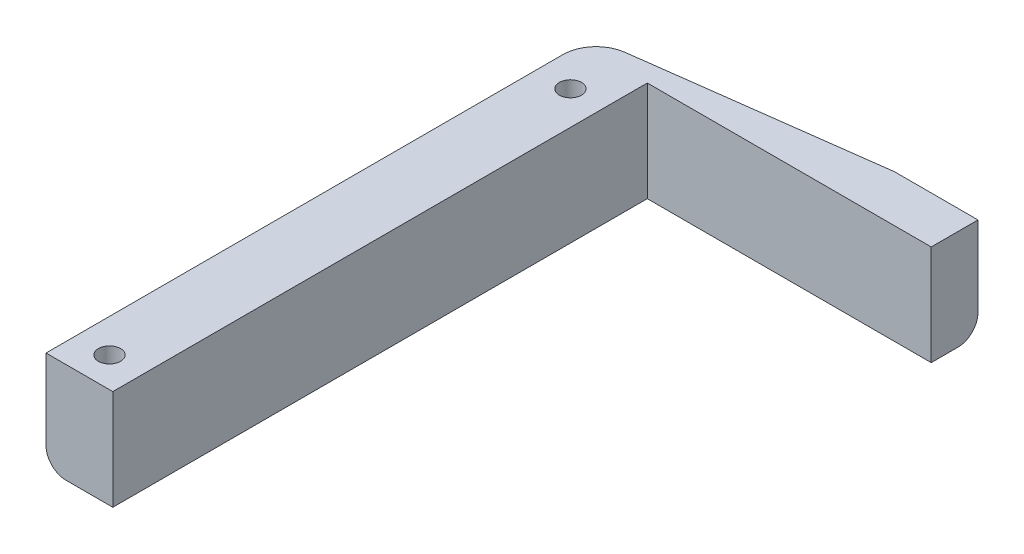
ISO-10303-21;
HEADER;
FILE_DESCRIPTION(('STEP AP214'),'2;1');
FILE_NAME('part.step','',(''),(''),'','','');
FILE_SCHEMA(('AUTOMOTIVE_DESIGN { 1 0 10303 214 1 1 1 1 }'));
ENDSEC;
DATA;
#1=APPLICATION_CONTEXT('core data for automotive mechanical design processes');
#2=APPLICATION_PROTOCOL_DEFINITION('international standard','automotive_design',2000,#1);
#3=PRODUCT_CONTEXT('',#1,'mechanical');
#4=PRODUCT('Part','Part','',(#3));
#5=PRODUCT_RELATED_PRODUCT_CATEGORY('part','',(#4));
#6=PRODUCT_DEFINITION_FORMATION('','',#4);
#7=PRODUCT_DEFINITION_CONTEXT('part definition',#1,'design');
#8=PRODUCT_DEFINITION('design','',#6,#7);
#9=PRODUCT_DEFINITION_SHAPE('','',#8);
#10=(LENGTH_UNIT() NAMED_UNIT(*) SI_UNIT(.MILLI.,.METRE.));
#11=(NAMED_UNIT(*) PLANE_ANGLE_UNIT() SI_UNIT($,.RADIAN.));
#12=(NAMED_UNIT(*) SI_UNIT($,.STERADIAN.) SOLID_ANGLE_UNIT());
#13=UNCERTAINTY_MEASURE_WITH_UNIT(LENGTH_MEASURE(1.E-05),#10,'distance_accuracy_value','');
#14=(GEOMETRIC_REPRESENTATION_CONTEXT(3) GLOBAL_UNCERTAINTY_ASSIGNED_CONTEXT((#13)) GLOBAL_UNIT_ASSIGNED_CONTEXT((#10,
#11,#12)) REPRESENTATION_CONTEXT('',''));
#15=CARTESIAN_POINT('',(0.,0.,0.));
#16=DIRECTION('',(0.,0.,1.));
#17=DIRECTION('',(1.,0.,0.));
#18=AXIS2_PLACEMENT_3D('',#15,#16,#17);
#19=CARTESIAN_POINT('',(0.,15.,0.));
#20=DIRECTION('',(0.,1.,0.));
#21=DIRECTION('',(0.,0.,1.));
#22=AXIS2_PLACEMENT_3D('',#19,#20,#21);
#23=PLANE('',#22);
#24=CARTESIAN_POINT('',(-35.2774040599402,15.,24.4533066809845));
#25=DIRECTION('',(0.,1.,0.));
#26=DIRECTION('',(0.,0.,1.));
#27=AXIS2_PLACEMENT_3D('',#24,#25,#26);
#28=CIRCLE('',#27,1.66);
#29=CARTESIAN_POINT('',(-35.2774040599402,15.,26.1133066809845));
#30=VERTEX_POINT('',#29);
#31=EDGE_CURVE('E155',#30,#30,#28,.T.);
#32=ORIENTED_EDGE('',*,*,#31,.F.);
#33=EDGE_LOOP('',(#32));
#34=FACE_BOUND('',#33,.T.);
#35=DIRECTION('',(0.991444861373811,0.,-0.130526192220048));
#36=VECTOR('',#35,1.);
#37=CARTESIAN_POINT('',(-7.51652102515629,15.,-57.0936454902174));
#38=LINE('',#37,#36);
#39=CARTESIAN_POINT('',(-0.277404059939151,15.,-58.0466933190155));
#40=VERTEX_POINT('',#39);
#41=CARTESIAN_POINT('',(-35.9300350210405,15.,-53.3529354074249));
#42=VERTEX_POINT('',#41);
#43=EDGE_CURVE('E170',#40,#42,#38,.F.);
#44=ORIENTED_EDGE('',*,*,#43,.T.);
#45=CARTESIAN_POINT('',(-35.2774040599402,15.,-48.3957111005558));
#46=DIRECTION('',(0.,1.,0.));
#47=DIRECTION('',(0.,0.,1.));
#48=AXIS2_PLACEMENT_3D('',#45,#46,#47);
#49=CIRCLE('',#48,5.);
#50=CARTESIAN_POINT('',(-40.2774040599402,15.,-48.3957111005558));
#51=VERTEX_POINT('',#50);
#52=EDGE_CURVE('E123',#42,#51,#49,.T.);
#53=ORIENTED_EDGE('',*,*,#52,.T.);
#54=DIRECTION('',(0.,0.,1.));
#55=VECTOR('',#54,1.);
#56=CARTESIAN_POINT('',(-40.2774040599402,15.,-58.0466933190154));
#57=LINE('',#56,#55);
#58=CARTESIAN_POINT('',(-40.2774040599402,15.,28.9533066809845));
#59=VERTEX_POINT('',#58);
#60=EDGE_CURVE('E115',#51,#59,#57,.T.);
#61=ORIENTED_EDGE('',*,*,#60,.T.);
#62=DIRECTION('',(1.,0.,0.));
#63=VECTOR('',#62,1.);
#64=CARTESIAN_POINT('',(-40.2774040599402,15.,28.9533066809845));
#65=LINE('',#64,#63);
#66=CARTESIAN_POINT('',(-30.2774040599402,15.,28.9533066809845));
#67=VERTEX_POINT('',#66);
#68=EDGE_CURVE('E120',#59,#67,#65,.T.);
#69=ORIENTED_EDGE('',*,*,#68,.T.);
#70=DIRECTION('',(0.,0.,-1.));
#71=VECTOR('',#70,1.);
#72=CARTESIAN_POINT('',(-30.2774040599402,15.,28.9533066809845));
#73=LINE('',#72,#71);
#74=CARTESIAN_POINT('',(-30.2774040599402,15.,-51.0466933190155));
#75=VERTEX_POINT('',#74);
#76=EDGE_CURVE('E142',#67,#75,#73,.T.);
#77=ORIENTED_EDGE('',*,*,#76,.T.);
#78=DIRECTION('',(1.,0.,0.));
#79=VECTOR('',#78,1.);
#80=CARTESIAN_POINT('',(-30.2774040599402,15.,-51.0466933190155));
#81=LINE('',#80,#79);
#82=CARTESIAN_POINT('',(12.2225959400597,15.,-51.0466933190155));
#83=VERTEX_POINT('',#82);
#84=EDGE_CURVE('E144',#75,#83,#81,.T.);
#85=ORIENTED_EDGE('',*,*,#84,.T.);
#86=DIRECTION('',(0.,0.,-1.));
#87=VECTOR('',#86,1.);
#88=CARTESIAN_POINT('',(12.2225959400597,15.,-51.0466933190155));
#89=LINE('',#88,#87);
#90=CARTESIAN_POINT('',(12.2225959400598,15.,-58.0466933190155));
#91=VERTEX_POINT('',#90);
#92=EDGE_CURVE('E149',#83,#91,#89,.T.);
#93=ORIENTED_EDGE('',*,*,#92,.T.);
#94=DIRECTION('',(-1.,0.,0.));
#95=VECTOR('',#94,1.);
#96=CARTESIAN_POINT('',(12.2225959400598,15.,-58.0466933190155));
#97=LINE('',#96,#95);
#98=EDGE_CURVE('E127',#91,#40,#97,.T.);
#99=ORIENTED_EDGE('',*,*,#98,.T.);
#100=EDGE_LOOP('',(#44,#53,#61,#69,#77,#85,#93,#99));
#101=FACE_BOUND('',#100,.T.);
#102=CARTESIAN_POINT('',(-35.2774040599403,15.,-44.5466933190155));
#103=DIRECTION('',(0.,1.,0.));
#104=DIRECTION('',(0.,0.,1.));
#105=AXIS2_PLACEMENT_3D('',#102,#103,#104);
#106=CIRCLE('',#105,1.66);
#107=CARTESIAN_POINT('',(-35.2774040599403,15.,-42.8866933190155));
#108=VERTEX_POINT('',#107);
#109=EDGE_CURVE('E208',#108,#108,#106,.T.);
#110=ORIENTED_EDGE('',*,*,#109,.F.);
#111=EDGE_LOOP('',(#110));
#112=FACE_BOUND('',#111,.T.);
#113=ADVANCED_FACE('F35',(#34,#101,#112),#23,.T.);
#114=CARTESIAN_POINT('',(0.,0.,0.));
#115=DIRECTION('',(0.,1.,0.));
#116=DIRECTION('',(0.,0.,1.));
#117=AXIS2_PLACEMENT_3D('',#114,#115,#116);
#118=PLANE('',#117);
#119=DIRECTION('',(1.,0.,0.));
#120=VECTOR('',#119,1.);
#121=CARTESIAN_POINT('',(-40.2774040599402,0.,28.9533066809845));
#122=LINE('',#121,#120);
#123=CARTESIAN_POINT('',(-37.2774040599402,0.,28.9533066809845));
#124=VERTEX_POINT('',#123);
#125=CARTESIAN_POINT('',(-30.2774040599402,0.,28.9533066809845));
#126=VERTEX_POINT('',#125);
#127=EDGE_CURVE('E152',#124,#126,#122,.T.);
#128=ORIENTED_EDGE('',*,*,#127,.F.);
#129=DIRECTION('',(0.,0.,1.));
#130=VECTOR('',#129,1.);
#131=CARTESIAN_POINT('',(-37.2774040599402,0.,0.));
#132=LINE('',#131,#130);
#133=CARTESIAN_POINT('',(-37.2774040599402,0.,-48.3957111005558));
#134=VERTEX_POINT('',#133);
#135=EDGE_CURVE('E184',#124,#134,#132,.F.);
#136=ORIENTED_EDGE('',*,*,#135,.T.);
#137=CARTESIAN_POINT('',(-35.2774040599402,0.,-48.3957111005558));
#138=DIRECTION('',(0.,1.,0.));
#139=DIRECTION('',(0.,0.,1.));
#140=AXIS2_PLACEMENT_3D('',#137,#138,#139);
#141=CIRCLE('',#140,2.);
#142=CARTESIAN_POINT('',(-35.5384564443803,0.,-50.3786008233034));
#143=VERTEX_POINT('',#142);
#144=EDGE_CURVE('E181',#134,#143,#141,.F.);
#145=ORIENTED_EDGE('',*,*,#144,.T.);
#146=DIRECTION('',(-0.991444861373811,0.,0.130526192220048));
#147=VECTOR('',#146,1.);
#148=CARTESIAN_POINT('',(0.114174516720995,0.,-55.072358734894));
#149=LINE('',#148,#147);
#150=CARTESIAN_POINT('',(-0.0807736714934411,0.,-55.0466933190155));
#151=VERTEX_POINT('',#150);
#152=EDGE_CURVE('E179',#143,#151,#149,.F.);
#153=ORIENTED_EDGE('',*,*,#152,.T.);
#154=DIRECTION('',(-1.,0.,0.));
#155=VECTOR('',#154,1.);
#156=CARTESIAN_POINT('',(0.,0.,-55.0466933190155));
#157=LINE('',#156,#155);
#158=CARTESIAN_POINT('',(12.2225959400597,0.,-55.0466933190155));
#159=VERTEX_POINT('',#158);
#160=EDGE_CURVE('E177',#151,#159,#157,.F.);
#161=ORIENTED_EDGE('',*,*,#160,.T.);
#162=DIRECTION('',(0.,0.,-1.));
#163=VECTOR('',#162,1.);
#164=CARTESIAN_POINT('',(12.2225959400597,0.,-51.0466933190155));
#165=LINE('',#164,#163);
#166=CARTESIAN_POINT('',(12.2225959400597,0.,-51.0466933190155));
#167=VERTEX_POINT('',#166);
#168=EDGE_CURVE('E159',#167,#159,#165,.T.);
#169=ORIENTED_EDGE('',*,*,#168,.F.);
#170=DIRECTION('',(1.,0.,0.));
#171=VECTOR('',#170,1.);
#172=CARTESIAN_POINT('',(-30.2774040599402,0.,-51.0466933190155));
#173=LINE('',#172,#171);
#174=CARTESIAN_POINT('',(-30.2774040599402,0.,-51.0466933190155));
#175=VERTEX_POINT('',#174);
#176=EDGE_CURVE('E157',#175,#167,#173,.T.);
#177=ORIENTED_EDGE('',*,*,#176,.F.);
#178=DIRECTION('',(0.,0.,-1.));
#179=VECTOR('',#178,1.);
#180=CARTESIAN_POINT('',(-30.2774040599402,0.,28.9533066809845));
#181=LINE('',#180,#179);
#182=EDGE_CURVE('E154',#126,#175,#181,.T.);
#183=ORIENTED_EDGE('',*,*,#182,.F.);
#184=EDGE_LOOP('',(#128,#136,#145,#153,#161,#169,#177,#183));
#185=FACE_BOUND('',#184,.T.);
#186=CARTESIAN_POINT('',(-35.2774040599402,0.,24.4533066809845));
#187=DIRECTION('',(0.,1.,0.));
#188=DIRECTION('',(0.,0.,1.));
#189=AXIS2_PLACEMENT_3D('',#186,#187,#188);
#190=CIRCLE('',#189,1.66);
#191=CARTESIAN_POINT('',(-35.2774040599402,0.,26.1133066809845));
#192=VERTEX_POINT('',#191);
#193=EDGE_CURVE('E213',#192,#192,#190,.T.);
#194=ORIENTED_EDGE('',*,*,#193,.T.);
#195=EDGE_LOOP('',(#194));
#196=FACE_BOUND('',#195,.T.);
#197=CARTESIAN_POINT('',(-35.2774040599403,0.,-44.5466933190155));
#198=DIRECTION('',(0.,1.,0.));
#199=DIRECTION('',(0.,0.,1.));
#200=AXIS2_PLACEMENT_3D('',#197,#198,#199);
#201=CIRCLE('',#200,1.66);
#202=CARTESIAN_POINT('',(-35.2774040599403,0.,-42.8866933190155));
#203=VERTEX_POINT('',#202);
#204=EDGE_CURVE('E202',#203,#203,#201,.T.);
#205=ORIENTED_EDGE('',*,*,#204,.T.);
#206=EDGE_LOOP('',(#205));
#207=FACE_BOUND('',#206,.T.);
#208=ADVANCED_FACE('F234',(#185,#196,#207),#118,.F.);
#209=CARTESIAN_POINT('',(12.2225959400598,15.,-58.0466933190155));
#210=DIRECTION('',(0.,0.,1.));
#211=DIRECTION('',(1.,0.,0.));
#212=AXIS2_PLACEMENT_3D('',#209,#210,#211);
#213=PLANE('',#212);
#214=DIRECTION('',(0.,-1.,0.));
#215=VECTOR('',#214,1.);
#216=CARTESIAN_POINT('',(12.2225959400598,15.,-58.0466933190155));
#217=LINE('',#216,#215);
#218=CARTESIAN_POINT('',(12.2225959400598,3.,-58.0466933190155));
#219=VERTEX_POINT('',#218);
#220=EDGE_CURVE('E151',#91,#219,#217,.T.);
#221=ORIENTED_EDGE('',*,*,#220,.T.);
#222=DIRECTION('',(-1.,0.,0.));
#223=VECTOR('',#222,1.);
#224=CARTESIAN_POINT('',(12.2225959400598,3.,-58.0466933190155));
#225=LINE('',#224,#223);
#226=CARTESIAN_POINT('',(-0.277404059939151,3.,-58.0466933190155));
#227=VERTEX_POINT('',#226);
#228=EDGE_CURVE('E44',#219,#227,#225,.T.);
#229=ORIENTED_EDGE('',*,*,#228,.T.);
#230=DIRECTION('',(0.,1.,0.));
#231=VECTOR('',#230,1.);
#232=CARTESIAN_POINT('',(-0.277404059939151,15.,-58.0466933190155));
#233=LINE('',#232,#231);
#234=EDGE_CURVE('E136',#227,#40,#233,.T.);
#235=ORIENTED_EDGE('',*,*,#234,.T.);
#236=ORIENTED_EDGE('',*,*,#98,.F.);
#237=EDGE_LOOP('',(#221,#229,#235,#236));
#238=FACE_BOUND('',#237,.T.);
#239=ADVANCED_FACE('F250',(#238),#213,.F.);
#240=CARTESIAN_POINT('',(-40.2774040599402,15.,-58.0466933190154));
#241=DIRECTION('',(1.,0.,0.));
#242=DIRECTION('',(0.,0.,-1.));
#243=AXIS2_PLACEMENT_3D('',#240,#241,#242);
#244=PLANE('',#243);
#245=DIRECTION('',(0.,1.,0.));
#246=VECTOR('',#245,1.);
#247=CARTESIAN_POINT('',(-40.2774040599402,0.,-48.3957111005558));
#248=LINE('',#247,#246);
#249=CARTESIAN_POINT('',(-40.2774040599402,3.,-48.3957111005558));
#250=VERTEX_POINT('',#249);
#251=EDGE_CURVE('E172',#51,#250,#248,.F.);
#252=ORIENTED_EDGE('',*,*,#251,.T.);
#253=DIRECTION('',(0.,0.,1.));
#254=VECTOR('',#253,1.);
#255=CARTESIAN_POINT('',(-40.2774040599402,3.,-58.0466933190154));
#256=LINE('',#255,#254);
#257=CARTESIAN_POINT('',(-40.2774040599402,3.,28.9533066809845));
#258=VERTEX_POINT('',#257);
#259=EDGE_CURVE('E133',#250,#258,#256,.T.);
#260=ORIENTED_EDGE('',*,*,#259,.T.);
#261=DIRECTION('',(0.,-1.,0.));
#262=VECTOR('',#261,1.);
#263=CARTESIAN_POINT('',(-40.2774040599402,15.,28.9533066809845));
#264=LINE('',#263,#262);
#265=EDGE_CURVE('E130',#59,#258,#264,.T.);
#266=ORIENTED_EDGE('',*,*,#265,.F.);
#267=ORIENTED_EDGE('',*,*,#60,.F.);
#268=EDGE_LOOP('',(#252,#260,#266,#267));
#269=FACE_BOUND('',#268,.T.);
#270=ADVANCED_FACE('F131',(#269),#244,.F.);
#271=CARTESIAN_POINT('',(-40.2774040599402,15.,28.9533066809845));
#272=DIRECTION('',(0.,0.,-1.));
#273=DIRECTION('',(-1.,0.,0.));
#274=AXIS2_PLACEMENT_3D('',#271,#272,#273);
#275=PLANE('',#274);
#276=ORIENTED_EDGE('',*,*,#265,.T.);
#277=CARTESIAN_POINT('',(-37.2774040599402,3.,28.9533066809845));
#278=DIRECTION('',(0.,0.,-1.));
#279=DIRECTION('',(-1.,0.,0.));
#280=AXIS2_PLACEMENT_3D('',#277,#278,#279);
#281=CIRCLE('',#280,3.);
#282=EDGE_CURVE('E189',#258,#124,#281,.F.);
#283=ORIENTED_EDGE('',*,*,#282,.T.);
#284=ORIENTED_EDGE('',*,*,#127,.T.);
#285=DIRECTION('',(0.,-1.,0.));
#286=VECTOR('',#285,1.);
#287=CARTESIAN_POINT('',(-30.2774040599402,15.,28.9533066809845));
#288=LINE('',#287,#286);
#289=EDGE_CURVE('E137',#67,#126,#288,.T.);
#290=ORIENTED_EDGE('',*,*,#289,.F.);
#291=ORIENTED_EDGE('',*,*,#68,.F.);
#292=EDGE_LOOP('',(#276,#283,#284,#290,#291));
#293=FACE_BOUND('',#292,.T.);
#294=ADVANCED_FACE('F139',(#293),#275,.F.);
#295=CARTESIAN_POINT('',(-30.2774040599402,15.,28.9533066809845));
#296=DIRECTION('',(-1.,0.,0.));
#297=DIRECTION('',(0.,0.,1.));
#298=AXIS2_PLACEMENT_3D('',#295,#296,#297);
#299=PLANE('',#298);
#300=ORIENTED_EDGE('',*,*,#182,.T.);
#301=DIRECTION('',(0.,-1.,0.));
#302=VECTOR('',#301,1.);
#303=CARTESIAN_POINT('',(-30.2774040599402,15.,-51.0466933190155));
#304=LINE('',#303,#302);
#305=EDGE_CURVE('E165',#75,#175,#304,.T.);
#306=ORIENTED_EDGE('',*,*,#305,.F.);
#307=ORIENTED_EDGE('',*,*,#76,.F.);
#308=ORIENTED_EDGE('',*,*,#289,.T.);
#309=EDGE_LOOP('',(#300,#306,#307,#308));
#310=FACE_BOUND('',#309,.T.);
#311=ADVANCED_FACE('F241',(#310),#299,.F.);
#312=CARTESIAN_POINT('',(-30.2774040599402,15.,-51.0466933190155));
#313=DIRECTION('',(0.,0.,-1.));
#314=DIRECTION('',(-1.,0.,0.));
#315=AXIS2_PLACEMENT_3D('',#312,#313,#314);
#316=PLANE('',#315);
#317=ORIENTED_EDGE('',*,*,#176,.T.);
#318=DIRECTION('',(0.,-1.,0.));
#319=VECTOR('',#318,1.);
#320=CARTESIAN_POINT('',(12.2225959400597,15.,-51.0466933190155));
#321=LINE('',#320,#319);
#322=EDGE_CURVE('E162',#83,#167,#321,.T.);
#323=ORIENTED_EDGE('',*,*,#322,.F.);
#324=ORIENTED_EDGE('',*,*,#84,.F.);
#325=ORIENTED_EDGE('',*,*,#305,.T.);
#326=EDGE_LOOP('',(#317,#323,#324,#325));
#327=FACE_BOUND('',#326,.T.);
#328=ADVANCED_FACE('F247',(#327),#316,.F.);
#329=CARTESIAN_POINT('',(12.2225959400597,15.,-51.0466933190155));
#330=DIRECTION('',(-1.,0.,0.));
#331=DIRECTION('',(0.,0.,1.));
#332=AXIS2_PLACEMENT_3D('',#329,#330,#331);
#333=PLANE('',#332);
#334=ORIENTED_EDGE('',*,*,#168,.T.);
#335=CARTESIAN_POINT('',(12.2225959400597,3.,-55.0466933190155));
#336=DIRECTION('',(-1.,0.,0.));
#337=DIRECTION('',(0.,0.,1.));
#338=AXIS2_PLACEMENT_3D('',#335,#336,#337);
#339=CIRCLE('',#338,3.);
#340=EDGE_CURVE('E11',#159,#219,#339,.F.);
#341=ORIENTED_EDGE('',*,*,#340,.T.);
#342=ORIENTED_EDGE('',*,*,#220,.F.);
#343=ORIENTED_EDGE('',*,*,#92,.F.);
#344=ORIENTED_EDGE('',*,*,#322,.T.);
#345=EDGE_LOOP('',(#334,#341,#342,#343,#344));
#346=FACE_BOUND('',#345,.T.);
#347=ADVANCED_FACE('F249',(#346),#333,.F.);
#348=CARTESIAN_POINT('',(-35.2774040599402,15.,24.4533066809845));
#349=DIRECTION('',(0.,-1.,0.));
#350=DIRECTION('',(0.,0.,-1.));
#351=AXIS2_PLACEMENT_3D('',#348,#349,#350);
#352=CYLINDRICAL_SURFACE('',#351,1.66);
#353=ORIENTED_EDGE('',*,*,#31,.T.);
#354=EDGE_LOOP('',(#353));
#355=FACE_BOUND('',#354,.T.);
#356=ORIENTED_EDGE('',*,*,#193,.F.);
#357=EDGE_LOOP('',(#356));
#358=FACE_BOUND('',#357,.T.);
#359=ADVANCED_FACE('F267',(#355,#358),#352,.F.);
#360=CARTESIAN_POINT('',(-35.2774040599403,15.,-44.5466933190155));
#361=DIRECTION('',(0.,-1.,0.));
#362=DIRECTION('',(0.,0.,-1.));
#363=AXIS2_PLACEMENT_3D('',#360,#361,#362);
#364=CYLINDRICAL_SURFACE('',#363,1.66);
#365=ORIENTED_EDGE('',*,*,#109,.T.);
#366=EDGE_LOOP('',(#365));
#367=FACE_BOUND('',#366,.T.);
#368=ORIENTED_EDGE('',*,*,#204,.F.);
#369=EDGE_LOOP('',(#368));
#370=FACE_BOUND('',#369,.T.);
#371=ADVANCED_FACE('F283',(#367,#370),#364,.F.);
#372=CARTESIAN_POINT('',(-40.2774040599402,15.,-52.7805934155196));
#373=DIRECTION('',(0.130526192220048,0.,0.991444861373811));
#374=DIRECTION('',(0.,-1.,0.));
#375=AXIS2_PLACEMENT_3D('',#372,#373,#374);
#376=PLANE('',#375);
#377=ORIENTED_EDGE('',*,*,#234,.F.);
#378=DIRECTION('',(0.991444861373811,0.,-0.130526192220048));
#379=VECTOR('',#378,1.);
#380=CARTESIAN_POINT('',(-35.9300350210405,3.,-53.3529354074249));
#381=LINE('',#380,#379);
#382=CARTESIAN_POINT('',(-35.9300350210405,3.,-53.3529354074249));
#383=VERTEX_POINT('',#382);
#384=EDGE_CURVE('E191',#227,#383,#381,.F.);
#385=ORIENTED_EDGE('',*,*,#384,.T.);
#386=DIRECTION('',(0.,-1.,0.));
#387=VECTOR('',#386,1.);
#388=CARTESIAN_POINT('',(-35.9300350210405,15.,-53.3529354074249));
#389=LINE('',#388,#387);
#390=EDGE_CURVE('E174',#383,#42,#389,.F.);
#391=ORIENTED_EDGE('',*,*,#390,.T.);
#392=ORIENTED_EDGE('',*,*,#43,.F.);
#393=EDGE_LOOP('',(#377,#385,#391,#392));
#394=FACE_BOUND('',#393,.T.);
#395=ADVANCED_FACE('F224',(#394),#376,.F.);
#396=CARTESIAN_POINT('',(-35.2774040599402,15.,-48.3957111005558));
#397=DIRECTION('',(0.,-1.,0.));
#398=DIRECTION('',(0.,0.,-1.));
#399=AXIS2_PLACEMENT_3D('',#396,#397,#398);
#400=CYLINDRICAL_SURFACE('',#399,5.);
#401=ORIENTED_EDGE('',*,*,#390,.F.);
#402=CARTESIAN_POINT('',(-35.2774040599402,3.,-48.3957111005558));
#403=DIRECTION('',(0.,1.,0.));
#404=DIRECTION('',(0.,0.,1.));
#405=AXIS2_PLACEMENT_3D('',#402,#403,#404);
#406=CIRCLE('',#405,5.);
#407=EDGE_CURVE('E186',#383,#250,#406,.T.);
#408=ORIENTED_EDGE('',*,*,#407,.T.);
#409=ORIENTED_EDGE('',*,*,#251,.F.);
#410=ORIENTED_EDGE('',*,*,#52,.F.);
#411=EDGE_LOOP('',(#401,#408,#409,#410));
#412=FACE_BOUND('',#411,.T.);
#413=ADVANCED_FACE('F227',(#412),#400,.T.);
#414=CARTESIAN_POINT('',(12.2225959400598,3.,-55.0466933190155));
#415=DIRECTION('',(-1.,0.,0.));
#416=DIRECTION('',(0.,0.,1.));
#417=AXIS2_PLACEMENT_3D('',#414,#415,#416);
#418=CYLINDRICAL_SURFACE('',#417,3.);
#419=ORIENTED_EDGE('',*,*,#340,.F.);
#420=ORIENTED_EDGE('',*,*,#160,.F.);
#421=CARTESIAN_POINT('',(-0.0807736714934846,3.,-55.0466933190154));
#422=DIRECTION('',(-0.997858923238603,0.,0.0654031292301415));
#423=DIRECTION('',(-0.0654031292301415,0.,-0.997858923238604));
#424=AXIS2_PLACEMENT_3D('',#421,#422,#423);
#425=ELLIPSE('',#424,3.0064370124219,3.);
#426=EDGE_CURVE('E39',#227,#151,#425,.T.);
#427=ORIENTED_EDGE('',*,*,#426,.F.);
#428=ORIENTED_EDGE('',*,*,#228,.F.);
#429=EDGE_LOOP('',(#419,#420,#427,#428));
#430=FACE_BOUND('',#429,.T.);
#431=ADVANCED_FACE('F37',(#430),#418,.T.);
#432=CARTESIAN_POINT('',(-37.2774040599402,3.,-58.0466933190154));
#433=DIRECTION('',(0.,0.,1.));
#434=DIRECTION('',(1.,0.,0.));
#435=AXIS2_PLACEMENT_3D('',#432,#433,#434);
#436=CYLINDRICAL_SURFACE('',#435,3.);
#437=ORIENTED_EDGE('',*,*,#282,.F.);
#438=ORIENTED_EDGE('',*,*,#259,.F.);
#439=CARTESIAN_POINT('',(-37.2774040599402,3.,-48.3957111005558));
#440=DIRECTION('',(0.,0.,-1.));
#441=DIRECTION('',(-1.,0.,0.));
#442=AXIS2_PLACEMENT_3D('',#439,#440,#441);
#443=CIRCLE('',#442,3.);
#444=EDGE_CURVE('E195',#134,#250,#443,.T.);
#445=ORIENTED_EDGE('',*,*,#444,.F.);
#446=ORIENTED_EDGE('',*,*,#135,.F.);
#447=EDGE_LOOP('',(#437,#438,#445,#446));
#448=FACE_BOUND('',#447,.T.);
#449=ADVANCED_FACE('F239',(#448),#436,.T.);
#450=CARTESIAN_POINT('',(-7.12494244849614,3.,-54.1193109060959));
#451=DIRECTION('',(0.991444861373811,0.,-0.130526192220048));
#452=DIRECTION('',(-0.130526192220048,0.,-0.991444861373811));
#453=AXIS2_PLACEMENT_3D('',#450,#451,#452);
#454=CYLINDRICAL_SURFACE('',#453,3.);
#455=ORIENTED_EDGE('',*,*,#426,.T.);
#456=ORIENTED_EDGE('',*,*,#152,.F.);
#457=CARTESIAN_POINT('',(-35.5384564443803,3.,-50.3786008233034));
#458=DIRECTION('',(-0.991444861373811,0.,0.130526192220049));
#459=DIRECTION('',(0.130526192220049,0.,0.991444861373811));
#460=AXIS2_PLACEMENT_3D('',#457,#458,#459);
#461=CIRCLE('',#460,3.);
#462=EDGE_CURVE('E194',#383,#143,#461,.T.);
#463=ORIENTED_EDGE('',*,*,#462,.F.);
#464=ORIENTED_EDGE('',*,*,#384,.F.);
#465=EDGE_LOOP('',(#455,#456,#463,#464));
#466=FACE_BOUND('',#465,.T.);
#467=ADVANCED_FACE('F230',(#466),#454,.T.);
#468=CARTESIAN_POINT('',(-35.2774040599402,3.,-48.3957111005558));
#469=DIRECTION('',(0.,1.,0.));
#470=DIRECTION('',(0.,0.,1.));
#471=AXIS2_PLACEMENT_3D('',#468,#469,#470);
#472=DEGENERATE_TOROIDAL_SURFACE('',#471,2.,3.,.T.);
#473=ORIENTED_EDGE('',*,*,#444,.T.);
#474=ORIENTED_EDGE('',*,*,#407,.F.);
#475=ORIENTED_EDGE('',*,*,#462,.T.);
#476=ORIENTED_EDGE('',*,*,#144,.F.);
#477=EDGE_LOOP('',(#473,#474,#475,#476));
#478=FACE_BOUND('',#477,.T.);
#479=ADVANCED_FACE('F229',(#478),#472,.T.);
#480=CLOSED_SHELL('',(#113,#208,#239,#270,#294,#311,#328,#347,#359,#371,#395,#413,#431,#449,
#467,#479));
#481=MANIFOLD_SOLID_BREP('B2',#480);
#482=ADVANCED_BREP_SHAPE_REPRESENTATION('',(#18,#481),#14);
#483=SHAPE_DEFINITION_REPRESENTATION(#9,#482);
ENDSEC;
END-ISO-10303-21;
